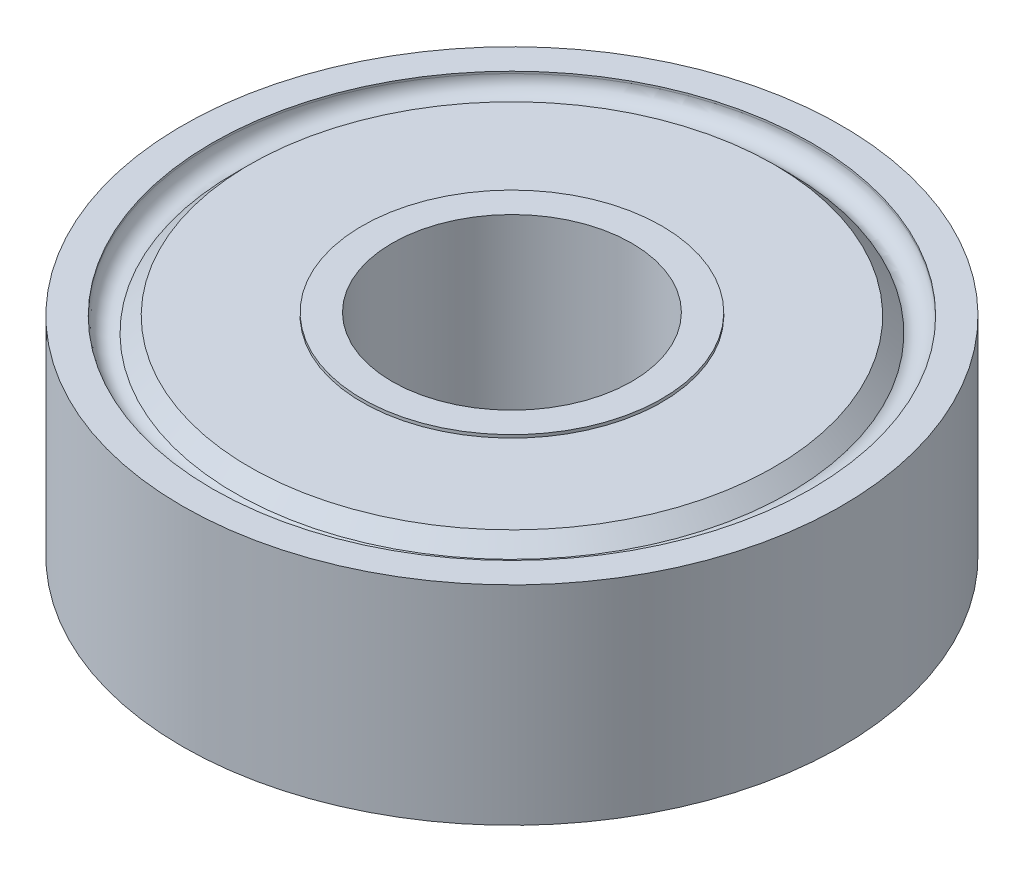
ISO-10303-21;
HEADER;
FILE_DESCRIPTION(('STEP AP214'),'2;1');
FILE_NAME('part.step','',(''),(''),'','','');
FILE_SCHEMA(('AUTOMOTIVE_DESIGN { 1 0 10303 214 1 1 1 1 }'));
ENDSEC;
DATA;
#1=APPLICATION_CONTEXT('core data for automotive mechanical design processes');
#2=APPLICATION_PROTOCOL_DEFINITION('international standard','automotive_design',2000,#1);
#3=PRODUCT_CONTEXT('',#1,'mechanical');
#4=PRODUCT('Part','Part','',(#3));
#5=PRODUCT_RELATED_PRODUCT_CATEGORY('part','',(#4));
#6=PRODUCT_DEFINITION_FORMATION('','',#4);
#7=PRODUCT_DEFINITION_CONTEXT('part definition',#1,'design');
#8=PRODUCT_DEFINITION('design','',#6,#7);
#9=PRODUCT_DEFINITION_SHAPE('','',#8);
#10=(LENGTH_UNIT() NAMED_UNIT(*) SI_UNIT(.MILLI.,.METRE.));
#11=(NAMED_UNIT(*) PLANE_ANGLE_UNIT() SI_UNIT($,.RADIAN.));
#12=(NAMED_UNIT(*) SI_UNIT($,.STERADIAN.) SOLID_ANGLE_UNIT());
#13=UNCERTAINTY_MEASURE_WITH_UNIT(LENGTH_MEASURE(1.E-05),#10,'distance_accuracy_value','');
#14=(GEOMETRIC_REPRESENTATION_CONTEXT(3) GLOBAL_UNCERTAINTY_ASSIGNED_CONTEXT((#13)) GLOBAL_UNIT_ASSIGNED_CONTEXT((#10,
#11,#12)) REPRESENTATION_CONTEXT('',''));
#15=CARTESIAN_POINT('',(0.,0.,0.));
#16=DIRECTION('',(0.,0.,1.));
#17=DIRECTION('',(1.,0.,0.));
#18=AXIS2_PLACEMENT_3D('',#15,#16,#17);
#19=CARTESIAN_POINT('',(0.,3.475,0.));
#20=DIRECTION('',(0.,-1.,0.));
#21=DIRECTION('',(0.,0.,-1.));
#22=AXIS2_PLACEMENT_3D('',#19,#20,#21);
#23=CYLINDRICAL_SURFACE('',#22,11.);
#24=CARTESIAN_POINT('',(0.,0.,0.));
#25=DIRECTION('',(0.,1.,0.));
#26=DIRECTION('',(0.,0.,1.));
#27=AXIS2_PLACEMENT_3D('',#24,#25,#26);
#28=CIRCLE('',#27,11.);
#29=CARTESIAN_POINT('',(0.,0.,11.));
#30=VERTEX_POINT('',#29);
#31=EDGE_CURVE('E63',#30,#30,#28,.T.);
#32=ORIENTED_EDGE('',*,*,#31,.T.);
#33=EDGE_LOOP('',(#32));
#34=FACE_BOUND('',#33,.T.);
#35=CARTESIAN_POINT('',(0.,6.95,0.));
#36=DIRECTION('',(0.,1.,0.));
#37=DIRECTION('',(0.,0.,1.));
#38=AXIS2_PLACEMENT_3D('',#35,#36,#37);
#39=CIRCLE('',#38,11.);
#40=CARTESIAN_POINT('',(0.,6.95,11.));
#41=VERTEX_POINT('',#40);
#42=EDGE_CURVE('E75',#41,#41,#39,.T.);
#43=ORIENTED_EDGE('',*,*,#42,.F.);
#44=EDGE_LOOP('',(#43));
#45=FACE_BOUND('',#44,.T.);
#46=ADVANCED_FACE('F34',(#34,#45),#23,.T.);
#47=CARTESIAN_POINT('',(0.,0.,0.));
#48=DIRECTION('',(0.,1.,0.));
#49=DIRECTION('',(0.,0.,1.));
#50=AXIS2_PLACEMENT_3D('',#47,#48,#49);
#51=PLANE('',#50);
#52=CARTESIAN_POINT('',(0.,0.,0.));
#53=DIRECTION('',(0.,-1.,0.));
#54=DIRECTION('',(0.,0.,-1.));
#55=AXIS2_PLACEMENT_3D('',#52,#53,#54);
#56=CIRCLE('',#55,10.);
#57=CARTESIAN_POINT('',(0.,0.,-10.));
#58=VERTEX_POINT('',#57);
#59=EDGE_CURVE('E66',#58,#58,#56,.T.);
#60=ORIENTED_EDGE('',*,*,#59,.F.);
#61=EDGE_LOOP('',(#60));
#62=FACE_BOUND('',#61,.T.);
#63=ORIENTED_EDGE('',*,*,#31,.F.);
#64=EDGE_LOOP('',(#63));
#65=FACE_BOUND('',#64,.T.);
#66=ADVANCED_FACE('F122',(#62,#65),#51,.F.);
#67=CARTESIAN_POINT('',(0.,0.5,0.));
#68=DIRECTION('',(0.,-1.,0.));
#69=DIRECTION('',(0.,0.,-1.));
#70=AXIS2_PLACEMENT_3D('',#67,#68,#69);
#71=CYLINDRICAL_SURFACE('',#70,10.);
#72=CARTESIAN_POINT('',(0.,0.0669872981077808,0.));
#73=DIRECTION('',(0.,1.,0.));
#74=DIRECTION('',(0.,0.,1.));
#75=AXIS2_PLACEMENT_3D('',#72,#73,#74);
#76=CIRCLE('',#75,10.);
#77=CARTESIAN_POINT('',(0.,0.0669872981077808,10.));
#78=VERTEX_POINT('',#77);
#79=EDGE_CURVE('E60',#78,#78,#76,.T.);
#80=ORIENTED_EDGE('',*,*,#79,.T.);
#81=EDGE_LOOP('',(#80));
#82=FACE_BOUND('',#81,.T.);
#83=ORIENTED_EDGE('',*,*,#59,.T.);
#84=EDGE_LOOP('',(#83));
#85=FACE_BOUND('',#84,.T.);
#86=ADVANCED_FACE('F128',(#82,#85),#71,.F.);
#87=CARTESIAN_POINT('',(0.,0.,0.));
#88=DIRECTION('',(0.,1.,0.));
#89=DIRECTION('',(0.,0.,1.));
#90=AXIS2_PLACEMENT_3D('',#87,#88,#89);
#91=CIRCLE('',#90,5.);
#92=CARTESIAN_POINT('',(0.,0.,5.));
#93=VERTEX_POINT('',#92);
#94=EDGE_CURVE('E49',#93,#93,#91,.F.);
#95=ORIENTED_EDGE('',*,*,#94,.F.);
#96=EDGE_LOOP('',(#95));
#97=FACE_BOUND('',#96,.T.);
#98=CARTESIAN_POINT('',(0.,0.,0.));
#99=DIRECTION('',(0.,1.,0.));
#100=DIRECTION('',(0.,0.,1.));
#101=AXIS2_PLACEMENT_3D('',#98,#99,#100);
#102=CIRCLE('',#101,8.74999999999998);
#103=CARTESIAN_POINT('',(0.,0.,8.74999999999998));
#104=VERTEX_POINT('',#103);
#105=EDGE_CURVE('E57',#104,#104,#102,.F.);
#106=ORIENTED_EDGE('',*,*,#105,.T.);
#107=EDGE_LOOP('',(#106));
#108=FACE_BOUND('',#107,.T.);
#109=ADVANCED_FACE('F131',(#97,#108),#51,.F.);
#110=CARTESIAN_POINT('',(0.,0.0669872981077808,0.));
#111=DIRECTION('',(0.,1.,0.));
#112=DIRECTION('',(0.,0.,1.));
#113=AXIS2_PLACEMENT_3D('',#110,#111,#112);
#114=TOROIDAL_SURFACE('',#113,9.5,0.5);
#115=CARTESIAN_POINT('',(0.,0.499999999999952,0.));
#116=DIRECTION('',(0.,1.,0.));
#117=DIRECTION('',(0.,0.,1.));
#118=AXIS2_PLACEMENT_3D('',#115,#116,#117);
#119=CIRCLE('',#118,9.24999999999994);
#120=CARTESIAN_POINT('',(0.,0.499999999999952,9.24999999999994));
#121=VERTEX_POINT('',#120);
#122=EDGE_CURVE('E54',#121,#121,#119,.T.);
#123=ORIENTED_EDGE('',*,*,#122,.T.);
#124=EDGE_LOOP('',(#123));
#125=FACE_BOUND('',#124,.T.);
#126=ORIENTED_EDGE('',*,*,#79,.F.);
#127=EDGE_LOOP('',(#126));
#128=FACE_BOUND('',#127,.T.);
#129=ADVANCED_FACE('F135',(#125,#128),#114,.F.);
#130=CARTESIAN_POINT('',(0.,0.,0.));
#131=DIRECTION('',(0.,1.,0.));
#132=DIRECTION('',(0.,0.,1.));
#133=AXIS2_PLACEMENT_3D('',#130,#131,#132);
#134=CONICAL_SURFACE('',#133,8.74999999999998,0.785398163397454);
#135=ORIENTED_EDGE('',*,*,#122,.F.);
#136=EDGE_LOOP('',(#135));
#137=FACE_BOUND('',#136,.T.);
#138=ORIENTED_EDGE('',*,*,#105,.F.);
#139=EDGE_LOOP('',(#138));
#140=FACE_BOUND('',#139,.T.);
#141=ADVANCED_FACE('F138',(#137,#140),#134,.T.);
#142=CARTESIAN_POINT('',(0.,3.475,0.));
#143=DIRECTION('',(0.,-1.,0.));
#144=DIRECTION('',(0.,0.,-1.));
#145=AXIS2_PLACEMENT_3D('',#142,#143,#144);
#146=CYLINDRICAL_SURFACE('',#145,4.);
#147=CARTESIAN_POINT('',(0.,-0.1,0.));
#148=DIRECTION('',(0.,-1.,0.));
#149=DIRECTION('',(0.,0.,-1.));
#150=AXIS2_PLACEMENT_3D('',#147,#148,#149);
#151=CIRCLE('',#150,4.);
#152=CARTESIAN_POINT('',(0.,-0.1,-4.));
#153=VERTEX_POINT('',#152);
#154=EDGE_CURVE('E72',#153,#153,#151,.T.);
#155=ORIENTED_EDGE('',*,*,#154,.T.);
#156=EDGE_LOOP('',(#155));
#157=FACE_BOUND('',#156,.T.);
#158=CARTESIAN_POINT('',(0.,7.05,0.));
#159=DIRECTION('',(0.,1.,0.));
#160=DIRECTION('',(0.,0.,1.));
#161=AXIS2_PLACEMENT_3D('',#158,#159,#160);
#162=CIRCLE('',#161,4.);
#163=CARTESIAN_POINT('',(0.,7.05,4.));
#164=VERTEX_POINT('',#163);
#165=EDGE_CURVE('E85',#164,#164,#162,.T.);
#166=ORIENTED_EDGE('',*,*,#165,.T.);
#167=EDGE_LOOP('',(#166));
#168=FACE_BOUND('',#167,.T.);
#169=ADVANCED_FACE('F91',(#157,#168),#146,.F.);
#170=CARTESIAN_POINT('',(0.,-0.1,0.));
#171=DIRECTION('',(0.,1.,0.));
#172=DIRECTION('',(0.,0.,1.));
#173=AXIS2_PLACEMENT_3D('',#170,#171,#172);
#174=CYLINDRICAL_SURFACE('',#173,5.);
#175=CARTESIAN_POINT('',(0.,-0.1,0.));
#176=DIRECTION('',(0.,-1.,0.));
#177=DIRECTION('',(0.,0.,-1.));
#178=AXIS2_PLACEMENT_3D('',#175,#176,#177);
#179=CIRCLE('',#178,5.);
#180=CARTESIAN_POINT('',(0.,-0.1,-5.));
#181=VERTEX_POINT('',#180);
#182=EDGE_CURVE('E69',#181,#181,#179,.T.);
#183=ORIENTED_EDGE('',*,*,#182,.F.);
#184=EDGE_LOOP('',(#183));
#185=FACE_BOUND('',#184,.T.);
#186=ORIENTED_EDGE('',*,*,#94,.T.);
#187=EDGE_LOOP('',(#186));
#188=FACE_BOUND('',#187,.T.);
#189=ADVANCED_FACE('F145',(#185,#188),#174,.T.);
#190=CARTESIAN_POINT('',(0.,-0.1,0.));
#191=DIRECTION('',(0.,-1.,0.));
#192=DIRECTION('',(0.,0.,-1.));
#193=AXIS2_PLACEMENT_3D('',#190,#191,#192);
#194=PLANE('',#193);
#195=ORIENTED_EDGE('',*,*,#154,.F.);
#196=EDGE_LOOP('',(#195));
#197=FACE_BOUND('',#196,.T.);
#198=ORIENTED_EDGE('',*,*,#182,.T.);
#199=EDGE_LOOP('',(#198));
#200=FACE_BOUND('',#199,.T.);
#201=ADVANCED_FACE('F119',(#197,#200),#194,.T.);
#202=CARTESIAN_POINT('',(0.,6.95,0.));
#203=DIRECTION('',(0.,-1.,0.));
#204=DIRECTION('',(0.,0.,1.));
#205=AXIS2_PLACEMENT_3D('',#202,#203,#204);
#206=PLANE('',#205);
#207=CARTESIAN_POINT('',(0.,6.95,0.));
#208=DIRECTION('',(0.,-1.,0.));
#209=DIRECTION('',(0.,0.,-1.));
#210=AXIS2_PLACEMENT_3D('',#207,#208,#209);
#211=CIRCLE('',#210,10.);
#212=CARTESIAN_POINT('',(0.,6.95,-10.));
#213=VERTEX_POINT('',#212);
#214=EDGE_CURVE('E78',#213,#213,#211,.T.);
#215=ORIENTED_EDGE('',*,*,#214,.T.);
#216=EDGE_LOOP('',(#215));
#217=FACE_BOUND('',#216,.T.);
#218=ORIENTED_EDGE('',*,*,#42,.T.);
#219=EDGE_LOOP('',(#218));
#220=FACE_BOUND('',#219,.T.);
#221=ADVANCED_FACE('F110',(#217,#220),#206,.F.);
#222=CARTESIAN_POINT('',(0.,6.45,0.));
#223=DIRECTION('',(0.,1.,0.));
#224=DIRECTION('',(0.,0.,1.));
#225=AXIS2_PLACEMENT_3D('',#222,#223,#224);
#226=CYLINDRICAL_SURFACE('',#225,10.);
#227=CARTESIAN_POINT('',(0.,6.88301270189222,0.));
#228=DIRECTION('',(0.,-1.,0.));
#229=DIRECTION('',(0.,0.,-1.));
#230=AXIS2_PLACEMENT_3D('',#227,#228,#229);
#231=CIRCLE('',#230,10.);
#232=CARTESIAN_POINT('',(0.,6.88301270189222,-10.));
#233=VERTEX_POINT('',#232);
#234=EDGE_CURVE('E45',#233,#233,#231,.T.);
#235=ORIENTED_EDGE('',*,*,#234,.T.);
#236=EDGE_LOOP('',(#235));
#237=FACE_BOUND('',#236,.T.);
#238=ORIENTED_EDGE('',*,*,#214,.F.);
#239=EDGE_LOOP('',(#238));
#240=FACE_BOUND('',#239,.T.);
#241=ADVANCED_FACE('F108',(#237,#240),#226,.F.);
#242=CARTESIAN_POINT('',(0.,6.95,0.));
#243=DIRECTION('',(0.,-1.,0.));
#244=DIRECTION('',(0.,0.,-1.));
#245=AXIS2_PLACEMENT_3D('',#242,#243,#244);
#246=CIRCLE('',#245,5.);
#247=CARTESIAN_POINT('',(0.,6.95,-5.));
#248=VERTEX_POINT('',#247);
#249=EDGE_CURVE('E82',#248,#248,#246,.T.);
#250=ORIENTED_EDGE('',*,*,#249,.T.);
#251=EDGE_LOOP('',(#250));
#252=FACE_BOUND('',#251,.T.);
#253=CARTESIAN_POINT('',(0.,6.95,0.));
#254=DIRECTION('',(0.,-1.,0.));
#255=DIRECTION('',(0.,0.,-1.));
#256=AXIS2_PLACEMENT_3D('',#253,#254,#255);
#257=CIRCLE('',#256,8.74999999999999);
#258=CARTESIAN_POINT('',(0.,6.95,-8.74999999999999));
#259=VERTEX_POINT('',#258);
#260=EDGE_CURVE('E41',#259,#259,#257,.F.);
#261=ORIENTED_EDGE('',*,*,#260,.T.);
#262=EDGE_LOOP('',(#261));
#263=FACE_BOUND('',#262,.T.);
#264=ADVANCED_FACE('F105',(#252,#263),#206,.F.);
#265=CARTESIAN_POINT('',(0.,6.88301270189222,0.));
#266=DIRECTION('',(0.,-1.,0.));
#267=DIRECTION('',(0.,0.,-1.));
#268=AXIS2_PLACEMENT_3D('',#265,#266,#267);
#269=TOROIDAL_SURFACE('',#268,9.5,0.5);
#270=CARTESIAN_POINT('',(0.,6.44999999999998,0.));
#271=DIRECTION('',(0.,-1.,0.));
#272=DIRECTION('',(0.,0.,-1.));
#273=AXIS2_PLACEMENT_3D('',#270,#271,#272);
#274=CIRCLE('',#273,9.25000000000001);
#275=CARTESIAN_POINT('',(0.,6.44999999999998,-9.25000000000001));
#276=VERTEX_POINT('',#275);
#277=EDGE_CURVE('E10',#276,#276,#274,.T.);
#278=ORIENTED_EDGE('',*,*,#277,.T.);
#279=EDGE_LOOP('',(#278));
#280=FACE_BOUND('',#279,.T.);
#281=ORIENTED_EDGE('',*,*,#234,.F.);
#282=EDGE_LOOP('',(#281));
#283=FACE_BOUND('',#282,.T.);
#284=ADVANCED_FACE('F107',(#280,#283),#269,.F.);
#285=CARTESIAN_POINT('',(0.,5.94999999999998,0.));
#286=DIRECTION('',(0.,-1.,0.));
#287=DIRECTION('',(0.,0.,-1.));
#288=AXIS2_PLACEMENT_3D('',#285,#286,#287);
#289=CONICAL_SURFACE('',#288,9.75,0.785398163397444);
#290=ORIENTED_EDGE('',*,*,#260,.F.);
#291=EDGE_LOOP('',(#290));
#292=FACE_BOUND('',#291,.T.);
#293=ORIENTED_EDGE('',*,*,#277,.F.);
#294=EDGE_LOOP('',(#293));
#295=FACE_BOUND('',#294,.T.);
#296=ADVANCED_FACE('F36',(#292,#295),#289,.T.);
#297=CARTESIAN_POINT('',(0.,7.05,0.));
#298=DIRECTION('',(0.,1.,0.));
#299=DIRECTION('',(0.,0.,-1.));
#300=AXIS2_PLACEMENT_3D('',#297,#298,#299);
#301=PLANE('',#300);
#302=ORIENTED_EDGE('',*,*,#165,.F.);
#303=EDGE_LOOP('',(#302));
#304=FACE_BOUND('',#303,.T.);
#305=CARTESIAN_POINT('',(0.,7.05,0.));
#306=DIRECTION('',(0.,-1.,0.));
#307=DIRECTION('',(0.,0.,-1.));
#308=AXIS2_PLACEMENT_3D('',#305,#306,#307);
#309=CIRCLE('',#308,5.);
#310=CARTESIAN_POINT('',(0.,7.05,-5.));
#311=VERTEX_POINT('',#310);
#312=EDGE_CURVE('E81',#311,#311,#309,.T.);
#313=ORIENTED_EDGE('',*,*,#312,.F.);
#314=EDGE_LOOP('',(#313));
#315=FACE_BOUND('',#314,.T.);
#316=ADVANCED_FACE('F93',(#304,#315),#301,.T.);
#317=CARTESIAN_POINT('',(0.,7.05,0.));
#318=DIRECTION('',(0.,-1.,0.));
#319=DIRECTION('',(0.,0.,-1.));
#320=AXIS2_PLACEMENT_3D('',#317,#318,#319);
#321=CYLINDRICAL_SURFACE('',#320,5.);
#322=ORIENTED_EDGE('',*,*,#312,.T.);
#323=EDGE_LOOP('',(#322));
#324=FACE_BOUND('',#323,.T.);
#325=ORIENTED_EDGE('',*,*,#249,.F.);
#326=EDGE_LOOP('',(#325));
#327=FACE_BOUND('',#326,.T.);
#328=ADVANCED_FACE('F96',(#324,#327),#321,.T.);
#329=CLOSED_SHELL('',(#46,#66,#86,#109,#129,#141,#169,#189,#201,#221,#241,#264,#284,#296,#316,#328));
#330=MANIFOLD_SOLID_BREP('B2',#329);
#331=ADVANCED_BREP_SHAPE_REPRESENTATION('',(#18,#330),#14);
#332=SHAPE_DEFINITION_REPRESENTATION(#9,#331);
ENDSEC;
END-ISO-10303-21;
